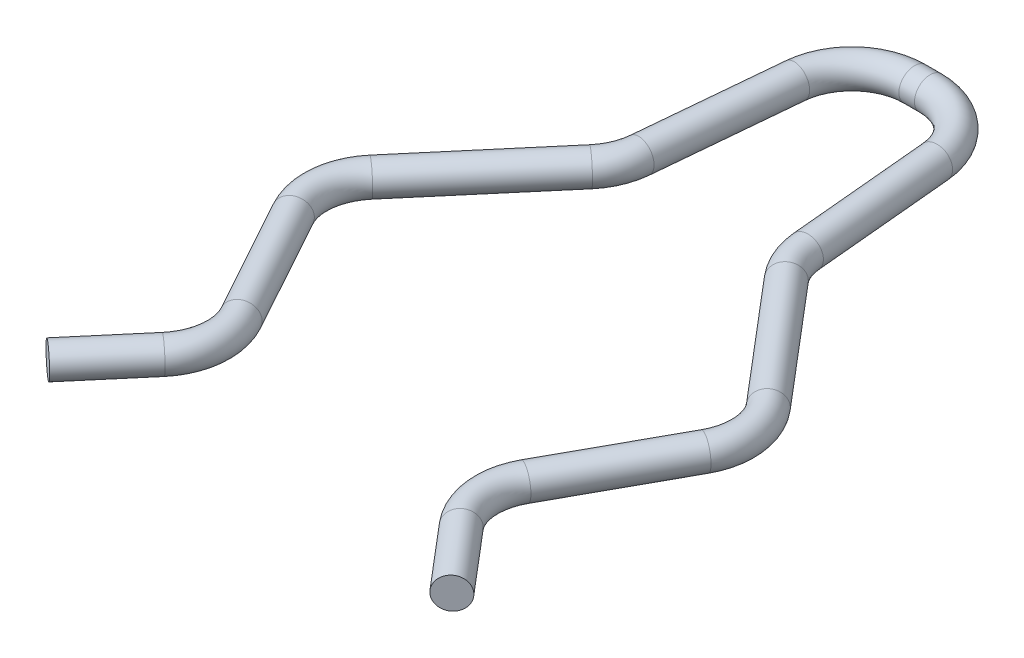
ISO-10303-21;
HEADER;
FILE_DESCRIPTION(('STEP AP214'),'2;1');
FILE_NAME('part.step','',(''),(''),'','','');
FILE_SCHEMA(('AUTOMOTIVE_DESIGN { 1 0 10303 214 1 1 1 1 }'));
ENDSEC;
DATA;
#1=APPLICATION_CONTEXT('core data for automotive mechanical design processes');
#2=APPLICATION_PROTOCOL_DEFINITION('international standard','automotive_design',2000,#1);
#3=PRODUCT_CONTEXT('',#1,'mechanical');
#4=PRODUCT('Part','Part','',(#3));
#5=PRODUCT_RELATED_PRODUCT_CATEGORY('part','',(#4));
#6=PRODUCT_DEFINITION_FORMATION('','',#4);
#7=PRODUCT_DEFINITION_CONTEXT('part definition',#1,'design');
#8=PRODUCT_DEFINITION('design','',#6,#7);
#9=PRODUCT_DEFINITION_SHAPE('','',#8);
#10=(LENGTH_UNIT() NAMED_UNIT(*) SI_UNIT(.MILLI.,.METRE.));
#11=(NAMED_UNIT(*) PLANE_ANGLE_UNIT() SI_UNIT($,.RADIAN.));
#12=(NAMED_UNIT(*) SI_UNIT($,.STERADIAN.) SOLID_ANGLE_UNIT());
#13=UNCERTAINTY_MEASURE_WITH_UNIT(LENGTH_MEASURE(1.E-05),#10,'distance_accuracy_value','');
#14=(GEOMETRIC_REPRESENTATION_CONTEXT(3) GLOBAL_UNCERTAINTY_ASSIGNED_CONTEXT((#13)) GLOBAL_UNIT_ASSIGNED_CONTEXT((#10,
#11,#12)) REPRESENTATION_CONTEXT('',''));
#15=CARTESIAN_POINT('',(0.,0.,0.));
#16=DIRECTION('',(0.,0.,1.));
#17=DIRECTION('',(1.,0.,0.));
#18=AXIS2_PLACEMENT_3D('',#15,#16,#17);
#19=CARTESIAN_POINT('',(-6.46367156918873,0.,8.45113101490637));
#20=DIRECTION('',(-0.647242381255319,0.,0.762284264501731));
#21=DIRECTION('',(0.762284264501731,0.,0.647242381255319));
#22=AXIS2_PLACEMENT_3D('',#19,#20,#21);
#23=PLANE('',#22);
#24=CARTESIAN_POINT('',(-6.46367156918873,0.,8.45113101490637));
#25=DIRECTION('',(-0.647242381255319,0.,0.762284264501731));
#26=DIRECTION('',(0.762284264501731,0.,0.647242381255319));
#27=AXIS2_PLACEMENT_3D('',#24,#25,#26);
#28=CIRCLE('',#27,0.499999999999999);
#29=CARTESIAN_POINT('',(-6.08252943693786,0.,8.77475220553403));
#30=VERTEX_POINT('',#29);
#31=EDGE_CURVE('E104',#30,#30,#28,.T.);
#32=ORIENTED_EDGE('',*,*,#31,.T.);
#33=EDGE_LOOP('',(#32));
#34=FACE_BOUND('',#33,.T.);
#35=ADVANCED_FACE('F46',(#34),#23,.T.);
#36=CARTESIAN_POINT('',(6.46367156918873,0.,8.45113101490637));
#37=DIRECTION('',(-0.647242381255319,0.,-0.76228426450173));
#38=DIRECTION('',(-0.762284264501731,0.,0.647242381255319));
#39=AXIS2_PLACEMENT_3D('',#36,#37,#38);
#40=PLANE('',#39);
#41=CARTESIAN_POINT('',(6.46367156918873,0.,8.45113101490637));
#42=DIRECTION('',(-0.647242381255319,0.,-0.76228426450173));
#43=DIRECTION('',(-0.762284264501731,0.,0.647242381255319));
#44=AXIS2_PLACEMENT_3D('',#41,#42,#43);
#45=CIRCLE('',#44,0.499999999999999);
#46=CARTESIAN_POINT('',(6.08252943693787,0.,8.77475220553403));
#47=VERTEX_POINT('',#46);
#48=EDGE_CURVE('E11',#47,#47,#45,.T.);
#49=ORIENTED_EDGE('',*,*,#48,.F.);
#50=EDGE_LOOP('',(#49));
#51=FACE_BOUND('',#50,.T.);
#52=ADVANCED_FACE('F112',(#51),#40,.F.);
#53=CARTESIAN_POINT('',(-6.46367156918873,0.,8.45113101490637));
#54=DIRECTION('',(0.647242381255319,0.,-0.762284264501731));
#55=DIRECTION('',(-0.762284264501731,0.,-0.647242381255319));
#56=AXIS2_PLACEMENT_3D('',#53,#54,#55);
#57=CYLINDRICAL_SURFACE('',#56,0.499999999999999);
#58=CARTESIAN_POINT('',(-4.76732142241254,0.,6.45326891344024));
#59=DIRECTION('',(-0.647242381255319,0.,0.762284264501731));
#60=DIRECTION('',(0.762284264501731,0.,0.647242381255319));
#61=AXIS2_PLACEMENT_3D('',#58,#59,#60);
#62=CIRCLE('',#61,0.499999999999999);
#63=CARTESIAN_POINT('',(-4.38617929016167,0.,6.7768901040679));
#64=VERTEX_POINT('',#63);
#65=EDGE_CURVE('E101',#64,#64,#62,.T.);
#66=ORIENTED_EDGE('',*,*,#65,.T.);
#67=EDGE_LOOP('',(#66));
#68=FACE_BOUND('',#67,.T.);
#69=ORIENTED_EDGE('',*,*,#31,.F.);
#70=EDGE_LOOP('',(#69));
#71=FACE_BOUND('',#70,.T.);
#72=ADVANCED_FACE('F109',(#68,#71),#57,.T.);
#73=CARTESIAN_POINT('',(-6.291889951416,0.,5.15878415092961));
#74=DIRECTION('',(0.,1.,0.));
#75=DIRECTION('',(0.,0.,1.));
#76=AXIS2_PLACEMENT_3D('',#73,#74,#75);
#77=TOROIDAL_SURFACE('',#76,2.,0.499999999999999);
#78=CARTESIAN_POINT('',(-4.53999755861344,0.,4.19396652876441));
#79=DIRECTION('',(0.482408811082599,0.,0.875946196401282));
#80=DIRECTION('',(0.875946196401282,0.,-0.482408811082599));
#81=AXIS2_PLACEMENT_3D('',#78,#79,#80);
#82=CIRCLE('',#81,0.499999999999999);
#83=CARTESIAN_POINT('',(-4.1020244604128,0.,3.95276212322311));
#84=VERTEX_POINT('',#83);
#85=EDGE_CURVE('E98',#84,#84,#82,.T.);
#86=CARTESIAN_POINT('',(-6.291889951416,0.,5.15878415092961));
#87=DIRECTION('',(0.,1.,0.));
#88=DIRECTION('',(0.,0.,1.));
#89=AXIS2_PLACEMENT_3D('',#86,#87,#88);
#90=CIRCLE('',#89,2.5);
#91=EDGE_CURVE('',#64,#84,#90,.T.);
#92=ORIENTED_EDGE('',*,*,#65,.F.);
#93=ORIENTED_EDGE('',*,*,#85,.T.);
#94=ORIENTED_EDGE('',*,*,#91,.T.);
#95=ORIENTED_EDGE('',*,*,#91,.F.);
#96=EDGE_LOOP('',(#92,#94,#93,#95));
#97=FACE_BOUND('',#96,.T.);
#98=ADVANCED_FACE('F111',(#97),#77,.T.);
#99=CARTESIAN_POINT('',(-4.53999755861344,0.,4.19396652876441));
#100=DIRECTION('',(-0.482408811082598,0.,-0.875946196401283));
#101=DIRECTION('',(-0.875946196401283,0.,0.482408811082598));
#102=AXIS2_PLACEMENT_3D('',#99,#100,#101);
#103=CYLINDRICAL_SURFACE('',#102,0.499999999999999);
#104=CARTESIAN_POINT('',(-6.58626820729966,0.,0.478398010225511));
#105=DIRECTION('',(0.482408811082598,0.,0.875946196401282));
#106=DIRECTION('',(0.875946196401283,0.,-0.482408811082598));
#107=AXIS2_PLACEMENT_3D('',#104,#105,#106);
#108=CIRCLE('',#107,0.499999999999999);
#109=CARTESIAN_POINT('',(-7.0242413055003,0.,0.71960241576681));
#110=VERTEX_POINT('',#109);
#111=EDGE_CURVE('E95',#110,#110,#108,.T.);
#112=ORIENTED_EDGE('',*,*,#111,.T.);
#113=EDGE_LOOP('',(#112));
#114=FACE_BOUND('',#113,.T.);
#115=ORIENTED_EDGE('',*,*,#85,.F.);
#116=EDGE_LOOP('',(#115));
#117=FACE_BOUND('',#116,.T.);
#118=ADVANCED_FACE('F119',(#114,#117),#103,.T.);
#119=CARTESIAN_POINT('',(-4.8343758144971,0.,-0.486419611939683));
#120=DIRECTION('',(0.,-1.,0.));
#121=DIRECTION('',(0.,0.,-1.));
#122=AXIS2_PLACEMENT_3D('',#119,#120,#121);
#123=TOROIDAL_SURFACE('',#122,2.,0.499999999999999);
#124=CARTESIAN_POINT('',(-6.35894434350055,0.,-1.78090437445032));
#125=DIRECTION('',(-0.647242381255319,0.,0.76228426450173));
#126=DIRECTION('',(0.762284264501731,0.,0.647242381255319));
#127=AXIS2_PLACEMENT_3D('',#124,#125,#126);
#128=CIRCLE('',#127,0.499999999999999);
#129=CARTESIAN_POINT('',(-6.74008647575142,0.,-2.10452556507798));
#130=VERTEX_POINT('',#129);
#131=EDGE_CURVE('E92',#130,#130,#128,.T.);
#132=CARTESIAN_POINT('',(-4.8343758144971,0.,-0.486419611939683));
#133=DIRECTION('',(0.,-1.,0.));
#134=DIRECTION('',(0.,0.,-1.));
#135=AXIS2_PLACEMENT_3D('',#132,#133,#134);
#136=CIRCLE('',#135,2.5);
#137=EDGE_CURVE('',#110,#130,#136,.T.);
#138=ORIENTED_EDGE('',*,*,#111,.F.);
#139=ORIENTED_EDGE('',*,*,#131,.T.);
#140=ORIENTED_EDGE('',*,*,#137,.T.);
#141=ORIENTED_EDGE('',*,*,#137,.F.);
#142=EDGE_LOOP('',(#138,#140,#139,#141));
#143=FACE_BOUND('',#142,.T.);
#144=ADVANCED_FACE('F176',(#143),#123,.T.);
#145=CARTESIAN_POINT('',(-6.35894434350055,0.,-1.78090437445032));
#146=DIRECTION('',(0.647242381255319,0.,-0.76228426450173));
#147=DIRECTION('',(-0.76228426450173,0.,-0.647242381255319));
#148=AXIS2_PLACEMENT_3D('',#145,#146,#147);
#149=CYLINDRICAL_SURFACE('',#148,0.499999999999999);
#150=CARTESIAN_POINT('',(-3.12965079786086,0.,-5.58417765597403));
#151=DIRECTION('',(-0.647242381255319,0.,0.76228426450173));
#152=DIRECTION('',(0.762284264501731,0.,0.647242381255319));
#153=AXIS2_PLACEMENT_3D('',#150,#151,#152);
#154=CIRCLE('',#153,0.499999999999999);
#155=CARTESIAN_POINT('',(-2.74850866560999,0.,-5.26055646534638));
#156=VERTEX_POINT('',#155);
#157=EDGE_CURVE('E89',#156,#156,#154,.T.);
#158=ORIENTED_EDGE('',*,*,#157,.T.);
#159=EDGE_LOOP('',(#158));
#160=FACE_BOUND('',#159,.T.);
#161=ORIENTED_EDGE('',*,*,#131,.F.);
#162=EDGE_LOOP('',(#161));
#163=FACE_BOUND('',#162,.T.);
#164=ADVANCED_FACE('F172',(#160,#163),#149,.T.);
#165=CARTESIAN_POINT('',(-4.65421932686432,0.,-6.87866241848467));
#166=DIRECTION('',(0.,1.,0.));
#167=DIRECTION('',(0.,0.,1.));
#168=AXIS2_PLACEMENT_3D('',#165,#166,#167);
#169=TOROIDAL_SURFACE('',#168,2.,0.499999999999999);
#170=CARTESIAN_POINT('',(-2.66271503567813,0.,-6.69451395070123));
#171=DIRECTION('',(-0.0920742338917238,0.,0.995752145593095));
#172=DIRECTION('',(0.995752145593095,0.,0.0920742338917238));
#173=AXIS2_PLACEMENT_3D('',#170,#171,#172);
#174=CIRCLE('',#173,0.499999999999999);
#175=CARTESIAN_POINT('',(-2.16483896288159,0.,-6.64847683375537));
#176=VERTEX_POINT('',#175);
#177=EDGE_CURVE('E86',#176,#176,#174,.T.);
#178=CARTESIAN_POINT('',(-4.65421932686432,0.,-6.87866241848467));
#179=DIRECTION('',(0.,1.,0.));
#180=DIRECTION('',(0.,0.,1.));
#181=AXIS2_PLACEMENT_3D('',#178,#179,#180);
#182=CIRCLE('',#181,2.5);
#183=EDGE_CURVE('',#156,#176,#182,.T.);
#184=ORIENTED_EDGE('',*,*,#157,.F.);
#185=ORIENTED_EDGE('',*,*,#177,.T.);
#186=ORIENTED_EDGE('',*,*,#183,.T.);
#187=ORIENTED_EDGE('',*,*,#183,.F.);
#188=EDGE_LOOP('',(#184,#186,#185,#187));
#189=FACE_BOUND('',#188,.T.);
#190=ADVANCED_FACE('F168',(#189),#169,.T.);
#191=CARTESIAN_POINT('',(-2.66271503567813,0.,-6.69451395070123));
#192=DIRECTION('',(0.0920742338917239,0.,-0.995752145593095));
#193=DIRECTION('',(-0.995752145593095,0.,-0.0920742338917239));
#194=AXIS2_PLACEMENT_3D('',#191,#192,#193);
#195=CYLINDRICAL_SURFACE('',#194,0.499999999999999);
#196=CARTESIAN_POINT('',(-2.24150429118619,0.,-11.2497677372051));
#197=DIRECTION('',(-0.0920742338917238,0.,0.995752145593095));
#198=DIRECTION('',(0.995752145593095,0.,0.0920742338917238));
#199=AXIS2_PLACEMENT_3D('',#196,#197,#198);
#200=CIRCLE('',#199,0.499999999999999);
#201=CARTESIAN_POINT('',(-2.73938036398274,0.,-11.295804854151));
#202=VERTEX_POINT('',#201);
#203=EDGE_CURVE('E83',#202,#202,#200,.T.);
#204=ORIENTED_EDGE('',*,*,#203,.T.);
#205=EDGE_LOOP('',(#204));
#206=FACE_BOUND('',#205,.T.);
#207=ORIENTED_EDGE('',*,*,#177,.F.);
#208=EDGE_LOOP('',(#207));
#209=FACE_BOUND('',#208,.T.);
#210=ADVANCED_FACE('F164',(#206,#209),#195,.T.);
#211=CARTESIAN_POINT('',(-0.25,0.,-11.0656192694216));
#212=DIRECTION('',(0.,-1.,0.));
#213=DIRECTION('',(0.,0.,-1.));
#214=AXIS2_PLACEMENT_3D('',#211,#212,#213);
#215=TOROIDAL_SURFACE('',#214,2.,0.499999999999999);
#216=CARTESIAN_POINT('',(-0.249999999999997,0.,-13.0656192694216));
#217=DIRECTION('',(-1.,0.,0.));
#218=DIRECTION('',(0.,0.,1.));
#219=AXIS2_PLACEMENT_3D('',#216,#217,#218);
#220=CIRCLE('',#219,0.499999999999999);
#221=CARTESIAN_POINT('',(-0.249999999999996,0.,-13.5656192694216));
#222=VERTEX_POINT('',#221);
#223=EDGE_CURVE('E80',#222,#222,#220,.T.);
#224=CARTESIAN_POINT('',(-0.25,0.,-11.0656192694216));
#225=DIRECTION('',(0.,-1.,0.));
#226=DIRECTION('',(0.,0.,-1.));
#227=AXIS2_PLACEMENT_3D('',#224,#225,#226);
#228=CIRCLE('',#227,2.5);
#229=EDGE_CURVE('',#202,#222,#228,.T.);
#230=ORIENTED_EDGE('',*,*,#203,.F.);
#231=ORIENTED_EDGE('',*,*,#223,.T.);
#232=ORIENTED_EDGE('',*,*,#229,.T.);
#233=ORIENTED_EDGE('',*,*,#229,.F.);
#234=EDGE_LOOP('',(#230,#232,#231,#233));
#235=FACE_BOUND('',#234,.T.);
#236=ADVANCED_FACE('F160',(#235),#215,.T.);
#237=CARTESIAN_POINT('',(-0.249999999999997,0.,-13.0656192694216));
#238=DIRECTION('',(1.,0.,0.));
#239=DIRECTION('',(0.,0.,-1.));
#240=AXIS2_PLACEMENT_3D('',#237,#238,#239);
#241=CYLINDRICAL_SURFACE('',#240,0.499999999999999);
#242=CARTESIAN_POINT('',(0.250000000000004,0.,-13.0656192694216));
#243=DIRECTION('',(-1.,0.,0.));
#244=DIRECTION('',(0.,0.,1.));
#245=AXIS2_PLACEMENT_3D('',#242,#243,#244);
#246=CIRCLE('',#245,0.499999999999999);
#247=CARTESIAN_POINT('',(0.250000000000004,0.,-13.5656192694216));
#248=VERTEX_POINT('',#247);
#249=EDGE_CURVE('E77',#248,#248,#246,.T.);
#250=ORIENTED_EDGE('',*,*,#249,.T.);
#251=EDGE_LOOP('',(#250));
#252=FACE_BOUND('',#251,.T.);
#253=ORIENTED_EDGE('',*,*,#223,.F.);
#254=EDGE_LOOP('',(#253));
#255=FACE_BOUND('',#254,.T.);
#256=ADVANCED_FACE('F156',(#252,#255),#241,.T.);
#257=CARTESIAN_POINT('',(0.250000000000001,0.,-11.0656192694216));
#258=DIRECTION('',(0.,-1.,0.));
#259=DIRECTION('',(0.,0.,-1.));
#260=AXIS2_PLACEMENT_3D('',#257,#258,#259);
#261=TOROIDAL_SURFACE('',#260,2.,0.499999999999999);
#262=CARTESIAN_POINT('',(2.24150429118619,0.,-11.2497677372051));
#263=DIRECTION('',(-0.092074233891724,0.,-0.995752145593095));
#264=DIRECTION('',(-0.995752145593095,0.,0.0920742338917239));
#265=AXIS2_PLACEMENT_3D('',#262,#263,#264);
#266=CIRCLE('',#265,0.499999999999999);
#267=CARTESIAN_POINT('',(2.73938036398274,0.,-11.2958048541509));
#268=VERTEX_POINT('',#267);
#269=EDGE_CURVE('E74',#268,#268,#266,.T.);
#270=CARTESIAN_POINT('',(0.250000000000001,0.,-11.0656192694216));
#271=DIRECTION('',(0.,-1.,0.));
#272=DIRECTION('',(0.,0.,-1.));
#273=AXIS2_PLACEMENT_3D('',#270,#271,#272);
#274=CIRCLE('',#273,2.5);
#275=EDGE_CURVE('',#248,#268,#274,.T.);
#276=ORIENTED_EDGE('',*,*,#249,.F.);
#277=ORIENTED_EDGE('',*,*,#269,.T.);
#278=ORIENTED_EDGE('',*,*,#275,.T.);
#279=ORIENTED_EDGE('',*,*,#275,.F.);
#280=EDGE_LOOP('',(#276,#278,#277,#279));
#281=FACE_BOUND('',#280,.T.);
#282=ADVANCED_FACE('F152',(#281),#261,.T.);
#283=CARTESIAN_POINT('',(2.24150429118619,0.,-11.2497677372051));
#284=DIRECTION('',(0.0920742338917245,0.,0.995752145593095));
#285=DIRECTION('',(0.995752145593095,0.,-0.0920742338917245));
#286=AXIS2_PLACEMENT_3D('',#283,#284,#285);
#287=CYLINDRICAL_SURFACE('',#286,0.499999999999999);
#288=CARTESIAN_POINT('',(2.66271503567814,0.,-6.69451395070122));
#289=DIRECTION('',(-0.0920742338917247,0.,-0.995752145593095));
#290=DIRECTION('',(-0.995752145593095,0.,0.0920742338917247));
#291=AXIS2_PLACEMENT_3D('',#288,#289,#290);
#292=CIRCLE('',#291,0.499999999999999);
#293=CARTESIAN_POINT('',(2.16483896288159,0.,-6.64847683375536));
#294=VERTEX_POINT('',#293);
#295=EDGE_CURVE('E71',#294,#294,#292,.T.);
#296=ORIENTED_EDGE('',*,*,#295,.T.);
#297=EDGE_LOOP('',(#296));
#298=FACE_BOUND('',#297,.T.);
#299=ORIENTED_EDGE('',*,*,#269,.F.);
#300=EDGE_LOOP('',(#299));
#301=FACE_BOUND('',#300,.T.);
#302=ADVANCED_FACE('F148',(#298,#301),#287,.T.);
#303=CARTESIAN_POINT('',(4.65421932686433,0.,-6.87866241848467));
#304=DIRECTION('',(0.,1.,0.));
#305=DIRECTION('',(0.,0.,1.));
#306=AXIS2_PLACEMENT_3D('',#303,#304,#305);
#307=TOROIDAL_SURFACE('',#306,2.,0.499999999999999);
#308=CARTESIAN_POINT('',(3.12965079786086,0.,-5.58417765597403));
#309=DIRECTION('',(-0.647242381255319,0.,-0.76228426450173));
#310=DIRECTION('',(-0.762284264501731,0.,0.647242381255319));
#311=AXIS2_PLACEMENT_3D('',#308,#309,#310);
#312=CIRCLE('',#311,0.499999999999999);
#313=CARTESIAN_POINT('',(2.74850866561,0.,-5.26055646534637));
#314=VERTEX_POINT('',#313);
#315=EDGE_CURVE('E68',#314,#314,#312,.T.);
#316=CARTESIAN_POINT('',(4.65421932686433,0.,-6.87866241848467));
#317=DIRECTION('',(0.,1.,0.));
#318=DIRECTION('',(0.,0.,1.));
#319=AXIS2_PLACEMENT_3D('',#316,#317,#318);
#320=CIRCLE('',#319,2.5);
#321=EDGE_CURVE('',#294,#314,#320,.T.);
#322=ORIENTED_EDGE('',*,*,#295,.F.);
#323=ORIENTED_EDGE('',*,*,#315,.T.);
#324=ORIENTED_EDGE('',*,*,#321,.T.);
#325=ORIENTED_EDGE('',*,*,#321,.F.);
#326=EDGE_LOOP('',(#322,#324,#323,#325));
#327=FACE_BOUND('',#326,.T.);
#328=ADVANCED_FACE('F144',(#327),#307,.T.);
#329=CARTESIAN_POINT('',(3.12965079786086,0.,-5.58417765597403));
#330=DIRECTION('',(0.647242381255319,0.,0.762284264501731));
#331=DIRECTION('',(0.76228426450173,0.,-0.647242381255319));
#332=AXIS2_PLACEMENT_3D('',#329,#330,#331);
#333=CYLINDRICAL_SURFACE('',#332,0.499999999999999);
#334=CARTESIAN_POINT('',(6.35894434350055,0.,-1.78090437445032));
#335=DIRECTION('',(-0.647242381255319,0.,-0.76228426450173));
#336=DIRECTION('',(-0.762284264501731,0.,0.647242381255319));
#337=AXIS2_PLACEMENT_3D('',#334,#335,#336);
#338=CIRCLE('',#337,0.499999999999999);
#339=CARTESIAN_POINT('',(6.74008647575141,0.,-2.10452556507797));
#340=VERTEX_POINT('',#339);
#341=EDGE_CURVE('E65',#340,#340,#338,.T.);
#342=ORIENTED_EDGE('',*,*,#341,.T.);
#343=EDGE_LOOP('',(#342));
#344=FACE_BOUND('',#343,.T.);
#345=ORIENTED_EDGE('',*,*,#315,.F.);
#346=EDGE_LOOP('',(#345));
#347=FACE_BOUND('',#346,.T.);
#348=ADVANCED_FACE('F140',(#344,#347),#333,.T.);
#349=CARTESIAN_POINT('',(4.8343758144971,0.,-0.486419611939683));
#350=DIRECTION('',(0.,-1.,0.));
#351=DIRECTION('',(0.,0.,-1.));
#352=AXIS2_PLACEMENT_3D('',#349,#350,#351);
#353=TOROIDAL_SURFACE('',#352,1.99999999999999,0.499999999999999);
#354=CARTESIAN_POINT('',(6.58626820729966,0.,0.478398010225518));
#355=DIRECTION('',(0.482408811082598,0.,-0.875946196401282));
#356=DIRECTION('',(-0.875946196401283,0.,-0.482408811082598));
#357=AXIS2_PLACEMENT_3D('',#354,#355,#356);
#358=CIRCLE('',#357,0.499999999999999);
#359=CARTESIAN_POINT('',(7.02424130550029,0.,0.719602415766814));
#360=VERTEX_POINT('',#359);
#361=EDGE_CURVE('E60',#360,#360,#358,.T.);
#362=CARTESIAN_POINT('',(4.8343758144971,0.,-0.486419611939683));
#363=DIRECTION('',(0.,-1.,0.));
#364=DIRECTION('',(0.,0.,-1.));
#365=AXIS2_PLACEMENT_3D('',#362,#363,#364);
#366=CIRCLE('',#365,2.49999999999999);
#367=EDGE_CURVE('',#340,#360,#366,.T.);
#368=ORIENTED_EDGE('',*,*,#341,.F.);
#369=ORIENTED_EDGE('',*,*,#361,.T.);
#370=ORIENTED_EDGE('',*,*,#367,.T.);
#371=ORIENTED_EDGE('',*,*,#367,.F.);
#372=EDGE_LOOP('',(#368,#370,#369,#371));
#373=FACE_BOUND('',#372,.T.);
#374=ADVANCED_FACE('F136',(#373),#353,.T.);
#375=CARTESIAN_POINT('',(6.58626820729966,0.,0.478398010225518));
#376=DIRECTION('',(-0.482408811082598,0.,0.875946196401283));
#377=DIRECTION('',(0.875946196401283,0.,0.482408811082598));
#378=AXIS2_PLACEMENT_3D('',#375,#376,#377);
#379=CYLINDRICAL_SURFACE('',#378,0.499999999999999);
#380=CARTESIAN_POINT('',(4.53999755861344,0.,4.19396652876442));
#381=DIRECTION('',(0.482408811082598,0.,-0.875946196401283));
#382=DIRECTION('',(-0.875946196401283,0.,-0.482408811082598));
#383=AXIS2_PLACEMENT_3D('',#380,#381,#382);
#384=CIRCLE('',#383,0.499999999999999);
#385=CARTESIAN_POINT('',(4.10202446041279,0.,3.95276212322312));
#386=VERTEX_POINT('',#385);
#387=EDGE_CURVE('E56',#386,#386,#384,.T.);
#388=ORIENTED_EDGE('',*,*,#387,.T.);
#389=EDGE_LOOP('',(#388));
#390=FACE_BOUND('',#389,.T.);
#391=ORIENTED_EDGE('',*,*,#361,.F.);
#392=EDGE_LOOP('',(#391));
#393=FACE_BOUND('',#392,.T.);
#394=ADVANCED_FACE('F130',(#390,#393),#379,.T.);
#395=CARTESIAN_POINT('',(6.291889951416,0.,5.15878415092961));
#396=DIRECTION('',(0.,1.,0.));
#397=DIRECTION('',(0.,0.,1.));
#398=AXIS2_PLACEMENT_3D('',#395,#396,#397);
#399=TOROIDAL_SURFACE('',#398,2.,0.499999999999999);
#400=CARTESIAN_POINT('',(4.76732142241254,0.,6.45326891344026));
#401=DIRECTION('',(-0.647242381255319,0.,-0.76228426450173));
#402=DIRECTION('',(-0.762284264501731,0.,0.647242381255319));
#403=AXIS2_PLACEMENT_3D('',#400,#401,#402);
#404=CIRCLE('',#403,0.499999999999999);
#405=CARTESIAN_POINT('',(4.38617929016168,0.,6.77689010406791));
#406=VERTEX_POINT('',#405);
#407=EDGE_CURVE('E52',#406,#406,#404,.T.);
#408=CARTESIAN_POINT('',(6.291889951416,0.,5.15878415092961));
#409=DIRECTION('',(0.,1.,0.));
#410=DIRECTION('',(0.,0.,1.));
#411=AXIS2_PLACEMENT_3D('',#408,#409,#410);
#412=CIRCLE('',#411,2.5);
#413=EDGE_CURVE('',#386,#406,#412,.T.);
#414=ORIENTED_EDGE('',*,*,#387,.F.);
#415=ORIENTED_EDGE('',*,*,#407,.T.);
#416=ORIENTED_EDGE('',*,*,#413,.T.);
#417=ORIENTED_EDGE('',*,*,#413,.F.);
#418=EDGE_LOOP('',(#414,#416,#415,#417));
#419=FACE_BOUND('',#418,.T.);
#420=ADVANCED_FACE('F125',(#419),#399,.T.);
#421=CARTESIAN_POINT('',(4.76732142241254,0.,6.45326891344025));
#422=DIRECTION('',(0.647242381255319,0.,0.762284264501731));
#423=DIRECTION('',(0.762284264501731,0.,-0.647242381255319));
#424=AXIS2_PLACEMENT_3D('',#421,#422,#423);
#425=CYLINDRICAL_SURFACE('',#424,0.499999999999999);
#426=ORIENTED_EDGE('',*,*,#48,.T.);
#427=EDGE_LOOP('',(#426));
#428=FACE_BOUND('',#427,.T.);
#429=ORIENTED_EDGE('',*,*,#407,.F.);
#430=EDGE_LOOP('',(#429));
#431=FACE_BOUND('',#430,.T.);
#432=ADVANCED_FACE('F123',(#428,#431),#425,.T.);
#433=CLOSED_SHELL('',(#35,#52,#72,#98,#118,#144,#164,#190,#210,#236,#256,#282,#302,#328,#348,
#374,#394,#420,#432));
#434=MANIFOLD_SOLID_BREP('B2',#433);
#435=ADVANCED_BREP_SHAPE_REPRESENTATION('',(#18,#434),#14);
#436=SHAPE_DEFINITION_REPRESENTATION(#9,#435);
ENDSEC;
END-ISO-10303-21;
